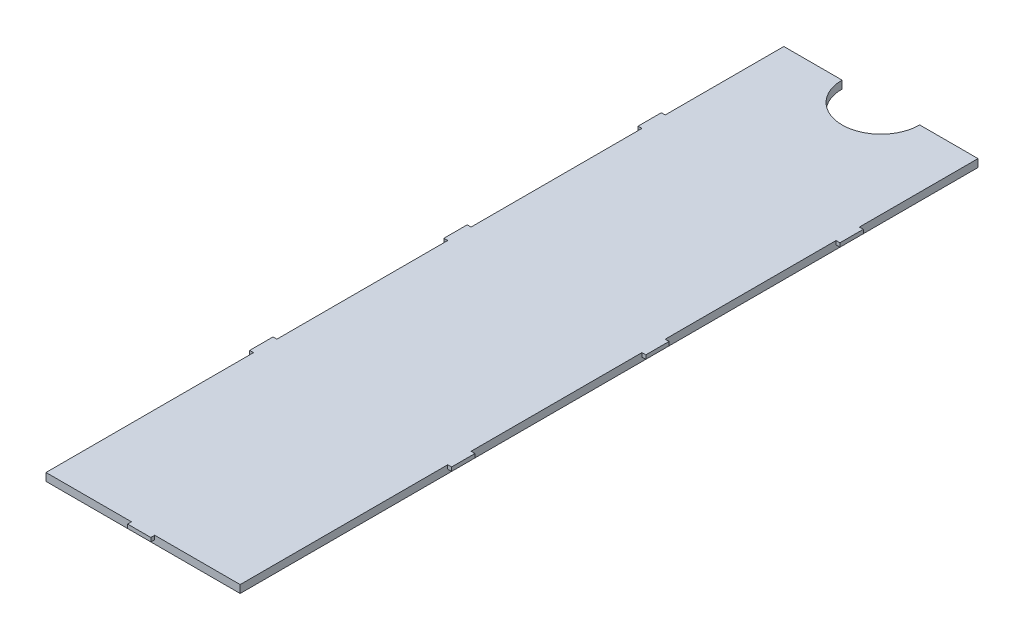
ISO-10303-21;
HEADER;
FILE_DESCRIPTION(('STEP AP214'),'2;1');
FILE_NAME('part.step','',(''),(''),'','','');
FILE_SCHEMA(('AUTOMOTIVE_DESIGN { 1 0 10303 214 1 1 1 1 }'));
ENDSEC;
DATA;
#1=APPLICATION_CONTEXT('core data for automotive mechanical design processes');
#2=APPLICATION_PROTOCOL_DEFINITION('international standard','automotive_design',2000,#1);
#3=PRODUCT_CONTEXT('',#1,'mechanical');
#4=PRODUCT('Part','Part','',(#3));
#5=PRODUCT_RELATED_PRODUCT_CATEGORY('part','',(#4));
#6=PRODUCT_DEFINITION_FORMATION('','',#4);
#7=PRODUCT_DEFINITION_CONTEXT('part definition',#1,'design');
#8=PRODUCT_DEFINITION('design','',#6,#7);
#9=PRODUCT_DEFINITION_SHAPE('','',#8);
#10=(LENGTH_UNIT() NAMED_UNIT(*) SI_UNIT(.MILLI.,.METRE.));
#11=(NAMED_UNIT(*) PLANE_ANGLE_UNIT() SI_UNIT($,.RADIAN.));
#12=(NAMED_UNIT(*) SI_UNIT($,.STERADIAN.) SOLID_ANGLE_UNIT());
#13=UNCERTAINTY_MEASURE_WITH_UNIT(LENGTH_MEASURE(1.E-05),#10,'distance_accuracy_value','');
#14=(GEOMETRIC_REPRESENTATION_CONTEXT(3) GLOBAL_UNCERTAINTY_ASSIGNED_CONTEXT((#13)) GLOBAL_UNIT_ASSIGNED_CONTEXT((#10,
#11,#12)) REPRESENTATION_CONTEXT('',''));
#15=CARTESIAN_POINT('',(0.,0.,0.));
#16=DIRECTION('',(0.,0.,1.));
#17=DIRECTION('',(1.,0.,0.));
#18=AXIS2_PLACEMENT_3D('',#15,#16,#17);
#19=CARTESIAN_POINT('',(0.,35.274050100301,1.80750317688863));
#20=DIRECTION('',(0.,0.,1.));
#21=DIRECTION('',(1.,0.,0.));
#22=AXIS2_PLACEMENT_3D('',#19,#20,#21);
#23=PLANE('',#22);
#24=DIRECTION('',(-1.,0.,0.));
#25=VECTOR('',#24,1.);
#26=CARTESIAN_POINT('',(0.,35.274050100301,1.80750317688863));
#27=LINE('',#26,#25);
#28=CARTESIAN_POINT('',(-86.6012572167533,35.274050100301,1.80750317688863));
#29=VERTEX_POINT('',#28);
#30=CARTESIAN_POINT('',(-94.1012572167536,35.274050100301,1.80750317688863));
#31=VERTEX_POINT('',#30);
#32=EDGE_CURVE('E280',#29,#31,#27,.T.);
#33=ORIENTED_EDGE('',*,*,#32,.F.);
#34=DIRECTION('',(0.,-1.,0.));
#35=VECTOR('',#34,1.);
#36=CARTESIAN_POINT('',(-86.6012572167533,35.274050100301,1.80750317688863));
#37=LINE('',#36,#35);
#38=CARTESIAN_POINT('',(-86.6012572167533,34.274050100301,1.80750317688863));
#39=VERTEX_POINT('',#38);
#40=EDGE_CURVE('E261',#29,#39,#37,.T.);
#41=ORIENTED_EDGE('',*,*,#40,.T.);
#42=DIRECTION('',(-1.,0.,0.));
#43=VECTOR('',#42,1.);
#44=CARTESIAN_POINT('',(0.,34.274050100301,1.80750317688863));
#45=LINE('',#44,#43);
#46=CARTESIAN_POINT('',(-94.1012572167536,34.274050100301,1.80750317688863));
#47=VERTEX_POINT('',#46);
#48=EDGE_CURVE('E296',#39,#47,#45,.T.);
#49=ORIENTED_EDGE('',*,*,#48,.T.);
#50=DIRECTION('',(0.,-1.,0.));
#51=VECTOR('',#50,1.);
#52=CARTESIAN_POINT('',(-94.1012572167536,35.274050100301,1.80750317688863));
#53=LINE('',#52,#51);
#54=EDGE_CURVE('E292',#31,#47,#53,.T.);
#55=ORIENTED_EDGE('',*,*,#54,.F.);
#56=EDGE_LOOP('',(#33,#41,#49,#55));
#57=FACE_BOUND('',#56,.T.);
#58=ADVANCED_FACE('F41',(#57),#23,.F.);
#59=CARTESIAN_POINT('',(-94.1012572167536,35.274050100301,0.));
#60=DIRECTION('',(1.,0.,0.));
#61=DIRECTION('',(0.,0.,-1.));
#62=AXIS2_PLACEMENT_3D('',#59,#60,#61);
#63=PLANE('',#62);
#64=DIRECTION('',(0.,0.,-1.));
#65=VECTOR('',#64,1.);
#66=CARTESIAN_POINT('',(-94.1012572167536,34.774050100301,0.));
#67=LINE('',#66,#65);
#68=CARTESIAN_POINT('',(-94.1012572167536,34.774050100301,20.0802620856482));
#69=VERTEX_POINT('',#68);
#70=CARTESIAN_POINT('',(-94.1012572167536,34.774050100301,17.0802620856482));
#71=VERTEX_POINT('',#70);
#72=EDGE_CURVE('E326',#69,#71,#67,.T.);
#73=ORIENTED_EDGE('',*,*,#72,.T.);
#74=DIRECTION('',(0.,1.,0.));
#75=VECTOR('',#74,1.);
#76=CARTESIAN_POINT('',(-94.1012572167536,35.274050100301,17.0802620856482));
#77=LINE('',#76,#75);
#78=CARTESIAN_POINT('',(-94.1012572167536,35.274050100301,17.0802620856482));
#79=VERTEX_POINT('',#78);
#80=EDGE_CURVE('E388',#71,#79,#77,.T.);
#81=ORIENTED_EDGE('',*,*,#80,.T.);
#82=DIRECTION('',(0.,0.,1.));
#83=VECTOR('',#82,1.);
#84=CARTESIAN_POINT('',(-94.1012572167536,35.274050100301,0.));
#85=LINE('',#84,#83);
#86=EDGE_CURVE('E284',#31,#79,#85,.T.);
#87=ORIENTED_EDGE('',*,*,#86,.F.);
#88=ORIENTED_EDGE('',*,*,#54,.T.);
#89=DIRECTION('',(0.,0.,1.));
#90=VECTOR('',#89,1.);
#91=CARTESIAN_POINT('',(-94.1012572167536,34.274050100301,0.));
#92=LINE('',#91,#90);
#93=CARTESIAN_POINT('',(-94.1012572167536,34.274050100301,96.8075031768886));
#94=VERTEX_POINT('',#93);
#95=EDGE_CURVE('E293',#47,#94,#92,.T.);
#96=ORIENTED_EDGE('',*,*,#95,.T.);
#97=DIRECTION('',(0.,-1.,0.));
#98=VECTOR('',#97,1.);
#99=CARTESIAN_POINT('',(-94.1012572167536,35.274050100301,96.8075031768886));
#100=LINE('',#99,#98);
#101=CARTESIAN_POINT('',(-94.1012572167536,35.274050100301,96.8075031768886));
#102=VERTEX_POINT('',#101);
#103=EDGE_CURVE('E306',#102,#94,#100,.T.);
#104=ORIENTED_EDGE('',*,*,#103,.F.);
#105=CARTESIAN_POINT('',(-94.1012572167536,35.274050100301,70.0802620856482));
#106=VERTEX_POINT('',#105);
#107=EDGE_CURVE('E305',#106,#102,#85,.T.);
#108=ORIENTED_EDGE('',*,*,#107,.F.);
#109=DIRECTION('',(0.,-1.,0.));
#110=VECTOR('',#109,1.);
#111=CARTESIAN_POINT('',(-94.1012572167536,35.274050100301,70.0802620856482));
#112=LINE('',#111,#110);
#113=CARTESIAN_POINT('',(-94.1012572167536,34.774050100301,70.0802620856482));
#114=VERTEX_POINT('',#113);
#115=EDGE_CURVE('E431',#106,#114,#112,.T.);
#116=ORIENTED_EDGE('',*,*,#115,.T.);
#117=DIRECTION('',(0.,0.,-1.));
#118=VECTOR('',#117,1.);
#119=CARTESIAN_POINT('',(-94.1012572167536,34.774050100301,0.));
#120=LINE('',#119,#118);
#121=CARTESIAN_POINT('',(-94.1012572167536,34.774050100301,67.0802620856482));
#122=VERTEX_POINT('',#121);
#123=EDGE_CURVE('E320',#114,#122,#120,.T.);
#124=ORIENTED_EDGE('',*,*,#123,.T.);
#125=DIRECTION('',(0.,1.,0.));
#126=VECTOR('',#125,1.);
#127=CARTESIAN_POINT('',(-94.1012572167536,35.274050100301,67.0802620856482));
#128=LINE('',#127,#126);
#129=CARTESIAN_POINT('',(-94.1012572167536,35.274050100301,67.0802620856482));
#130=VERTEX_POINT('',#129);
#131=EDGE_CURVE('E440',#122,#130,#128,.T.);
#132=ORIENTED_EDGE('',*,*,#131,.T.);
#133=CARTESIAN_POINT('',(-94.1012572167536,35.274050100301,45.0802620856482));
#134=VERTEX_POINT('',#133);
#135=EDGE_CURVE('E915',#134,#130,#85,.T.);
#136=ORIENTED_EDGE('',*,*,#135,.F.);
#137=DIRECTION('',(0.,-1.,0.));
#138=VECTOR('',#137,1.);
#139=CARTESIAN_POINT('',(-94.1012572167536,35.274050100301,45.0802620856482));
#140=LINE('',#139,#138);
#141=CARTESIAN_POINT('',(-94.1012572167536,34.774050100301,45.0802620856482));
#142=VERTEX_POINT('',#141);
#143=EDGE_CURVE('E405',#134,#142,#140,.T.);
#144=ORIENTED_EDGE('',*,*,#143,.T.);
#145=DIRECTION('',(0.,0.,-1.));
#146=VECTOR('',#145,1.);
#147=CARTESIAN_POINT('',(-94.1012572167536,34.774050100301,0.));
#148=LINE('',#147,#146);
#149=CARTESIAN_POINT('',(-94.1012572167536,34.774050100301,42.0802620856482));
#150=VERTEX_POINT('',#149);
#151=EDGE_CURVE('E323',#142,#150,#148,.T.);
#152=ORIENTED_EDGE('',*,*,#151,.T.);
#153=DIRECTION('',(0.,1.,0.));
#154=VECTOR('',#153,1.);
#155=CARTESIAN_POINT('',(-94.1012572167536,35.274050100301,42.0802620856482));
#156=LINE('',#155,#154);
#157=CARTESIAN_POINT('',(-94.1012572167536,35.274050100301,42.0802620856482));
#158=VERTEX_POINT('',#157);
#159=EDGE_CURVE('E414',#150,#158,#156,.T.);
#160=ORIENTED_EDGE('',*,*,#159,.T.);
#161=CARTESIAN_POINT('',(-94.1012572167536,35.274050100301,20.0802620856482));
#162=VERTEX_POINT('',#161);
#163=EDGE_CURVE('E914',#162,#158,#85,.T.);
#164=ORIENTED_EDGE('',*,*,#163,.F.);
#165=DIRECTION('',(0.,-1.,0.));
#166=VECTOR('',#165,1.);
#167=CARTESIAN_POINT('',(-94.1012572167536,35.274050100301,20.0802620856482));
#168=LINE('',#167,#166);
#169=EDGE_CURVE('E380',#162,#69,#168,.T.);
#170=ORIENTED_EDGE('',*,*,#169,.T.);
#171=EDGE_LOOP('',(#73,#81,#87,#88,#96,#104,#108,#116,#124,#132,#136,#144,#152,#160,#164,#170));
#172=FACE_BOUND('',#171,.T.);
#173=ADVANCED_FACE('F43',(#172),#63,.F.);
#174=CARTESIAN_POINT('',(0.,35.274050100301,96.8075031768886));
#175=DIRECTION('',(0.,0.,1.));
#176=DIRECTION('',(1.,0.,0.));
#177=AXIS2_PLACEMENT_3D('',#174,#175,#176);
#178=PLANE('',#177);
#179=DIRECTION('',(0.,1.,0.));
#180=VECTOR('',#179,1.);
#181=CARTESIAN_POINT('',(-80.1012572167533,35.274050100301,96.8075031768886));
#182=LINE('',#181,#180);
#183=CARTESIAN_POINT('',(-80.1012572167533,34.774050100301,96.8075031768886));
#184=VERTEX_POINT('',#183);
#185=CARTESIAN_POINT('',(-80.1012572167533,35.274050100301,96.8075031768886));
#186=VERTEX_POINT('',#185);
#187=EDGE_CURVE('E467',#184,#186,#182,.T.);
#188=ORIENTED_EDGE('',*,*,#187,.F.);
#189=DIRECTION('',(1.,0.,0.));
#190=VECTOR('',#189,1.);
#191=CARTESIAN_POINT('',(0.,34.774050100301,96.8075031768886));
#192=LINE('',#191,#190);
#193=CARTESIAN_POINT('',(-83.1012572167533,34.774050100301,96.8075031768886));
#194=VERTEX_POINT('',#193);
#195=EDGE_CURVE('E317',#194,#184,#192,.T.);
#196=ORIENTED_EDGE('',*,*,#195,.F.);
#197=DIRECTION('',(0.,-1.,0.));
#198=VECTOR('',#197,1.);
#199=CARTESIAN_POINT('',(-83.1012572167533,35.274050100301,96.8075031768886));
#200=LINE('',#199,#198);
#201=CARTESIAN_POINT('',(-83.1012572167533,35.274050100301,96.8075031768886));
#202=VERTEX_POINT('',#201);
#203=EDGE_CURVE('E458',#202,#194,#200,.T.);
#204=ORIENTED_EDGE('',*,*,#203,.F.);
#205=DIRECTION('',(-1.,0.,0.));
#206=VECTOR('',#205,1.);
#207=CARTESIAN_POINT('',(0.,35.274050100301,96.8075031768886));
#208=LINE('',#207,#206);
#209=EDGE_CURVE('E288',#202,#102,#208,.T.);
#210=ORIENTED_EDGE('',*,*,#209,.T.);
#211=ORIENTED_EDGE('',*,*,#103,.T.);
#212=DIRECTION('',(-1.,0.,0.));
#213=VECTOR('',#212,1.);
#214=CARTESIAN_POINT('',(0.,34.274050100301,96.8075031768886));
#215=LINE('',#214,#213);
#216=CARTESIAN_POINT('',(-69.1012572167529,34.274050100301,96.8075031768886));
#217=VERTEX_POINT('',#216);
#218=EDGE_CURVE('E302',#217,#94,#215,.T.);
#219=ORIENTED_EDGE('',*,*,#218,.F.);
#220=DIRECTION('',(0.,-1.,0.));
#221=VECTOR('',#220,1.);
#222=CARTESIAN_POINT('',(-69.1012572167529,35.274050100301,96.8075031768886));
#223=LINE('',#222,#221);
#224=CARTESIAN_POINT('',(-69.1012572167529,35.274050100301,96.8075031768886));
#225=VERTEX_POINT('',#224);
#226=EDGE_CURVE('E309',#225,#217,#223,.T.);
#227=ORIENTED_EDGE('',*,*,#226,.F.);
#228=EDGE_CURVE('E290',#225,#186,#208,.T.);
#229=ORIENTED_EDGE('',*,*,#228,.T.);
#230=EDGE_LOOP('',(#188,#196,#204,#210,#211,#219,#227,#229));
#231=FACE_BOUND('',#230,.T.);
#232=ADVANCED_FACE('F527',(#231),#178,.T.);
#233=CARTESIAN_POINT('',(-69.1012572167529,35.274050100301,0.));
#234=DIRECTION('',(1.,0.,0.));
#235=DIRECTION('',(0.,0.,-1.));
#236=AXIS2_PLACEMENT_3D('',#233,#234,#235);
#237=PLANE('',#236);
#238=DIRECTION('',(0.,1.,0.));
#239=VECTOR('',#238,1.);
#240=CARTESIAN_POINT('',(-69.1012572167529,35.274050100301,67.0802620856482));
#241=LINE('',#240,#239);
#242=CARTESIAN_POINT('',(-69.1012572167529,34.774050100301,67.0802620856482));
#243=VERTEX_POINT('',#242);
#244=CARTESIAN_POINT('',(-69.1012572167529,35.274050100301,67.0802620856482));
#245=VERTEX_POINT('',#244);
#246=EDGE_CURVE('E890',#243,#245,#241,.T.);
#247=ORIENTED_EDGE('',*,*,#246,.F.);
#248=DIRECTION('',(0.,0.,-1.));
#249=VECTOR('',#248,1.);
#250=CARTESIAN_POINT('',(-69.1012572167529,34.774050100301,0.));
#251=LINE('',#250,#249);
#252=CARTESIAN_POINT('',(-69.1012572167529,34.774050100301,70.0802620856482));
#253=VERTEX_POINT('',#252);
#254=EDGE_CURVE('E11',#253,#243,#251,.T.);
#255=ORIENTED_EDGE('',*,*,#254,.F.);
#256=DIRECTION('',(0.,-1.,0.));
#257=VECTOR('',#256,1.);
#258=CARTESIAN_POINT('',(-69.1012572167529,35.274050100301,70.0802620856482));
#259=LINE('',#258,#257);
#260=CARTESIAN_POINT('',(-69.1012572167529,35.274050100301,70.0802620856482));
#261=VERTEX_POINT('',#260);
#262=EDGE_CURVE('E875',#261,#253,#259,.T.);
#263=ORIENTED_EDGE('',*,*,#262,.F.);
#264=DIRECTION('',(0.,0.,1.));
#265=VECTOR('',#264,1.);
#266=CARTESIAN_POINT('',(-69.1012572167529,35.274050100301,0.));
#267=LINE('',#266,#265);
#268=EDGE_CURVE('E279',#261,#225,#267,.T.);
#269=ORIENTED_EDGE('',*,*,#268,.T.);
#270=ORIENTED_EDGE('',*,*,#226,.T.);
#271=DIRECTION('',(0.,0.,1.));
#272=VECTOR('',#271,1.);
#273=CARTESIAN_POINT('',(-69.1012572167529,34.274050100301,0.));
#274=LINE('',#273,#272);
#275=CARTESIAN_POINT('',(-69.1012572167529,34.274050100301,1.80750317688863));
#276=VERTEX_POINT('',#275);
#277=EDGE_CURVE('E299',#276,#217,#274,.T.);
#278=ORIENTED_EDGE('',*,*,#277,.F.);
#279=DIRECTION('',(0.,-1.,0.));
#280=VECTOR('',#279,1.);
#281=CARTESIAN_POINT('',(-69.1012572167529,35.274050100301,1.80750317688863));
#282=LINE('',#281,#280);
#283=CARTESIAN_POINT('',(-69.1012572167529,35.274050100301,1.80750317688863));
#284=VERTEX_POINT('',#283);
#285=EDGE_CURVE('E311',#284,#276,#282,.T.);
#286=ORIENTED_EDGE('',*,*,#285,.F.);
#287=CARTESIAN_POINT('',(-69.1012572167529,35.274050100301,17.0802620856482));
#288=VERTEX_POINT('',#287);
#289=EDGE_CURVE('E278',#284,#288,#267,.T.);
#290=ORIENTED_EDGE('',*,*,#289,.T.);
#291=DIRECTION('',(0.,1.,0.));
#292=VECTOR('',#291,1.);
#293=CARTESIAN_POINT('',(-69.1012572167529,35.274050100301,17.0802620856482));
#294=LINE('',#293,#292);
#295=CARTESIAN_POINT('',(-69.1012572167529,34.774050100301,17.0802620856482));
#296=VERTEX_POINT('',#295);
#297=EDGE_CURVE('E297',#296,#288,#294,.T.);
#298=ORIENTED_EDGE('',*,*,#297,.F.);
#299=DIRECTION('',(0.,0.,-1.));
#300=VECTOR('',#299,1.);
#301=CARTESIAN_POINT('',(-69.1012572167529,34.774050100301,0.));
#302=LINE('',#301,#300);
#303=CARTESIAN_POINT('',(-69.1012572167529,34.774050100301,20.0802620856482));
#304=VERTEX_POINT('',#303);
#305=EDGE_CURVE('E308',#304,#296,#302,.T.);
#306=ORIENTED_EDGE('',*,*,#305,.F.);
#307=DIRECTION('',(0.,-1.,0.));
#308=VECTOR('',#307,1.);
#309=CARTESIAN_POINT('',(-69.1012572167529,35.274050100301,20.0802620856482));
#310=LINE('',#309,#308);
#311=CARTESIAN_POINT('',(-69.1012572167529,35.274050100301,20.0802620856482));
#312=VERTEX_POINT('',#311);
#313=EDGE_CURVE('E490',#312,#304,#310,.T.);
#314=ORIENTED_EDGE('',*,*,#313,.F.);
#315=CARTESIAN_POINT('',(-69.1012572167529,35.274050100301,42.0802620856482));
#316=VERTEX_POINT('',#315);
#317=EDGE_CURVE('E289',#312,#316,#267,.T.);
#318=ORIENTED_EDGE('',*,*,#317,.T.);
#319=DIRECTION('',(0.,1.,0.));
#320=VECTOR('',#319,1.);
#321=CARTESIAN_POINT('',(-69.1012572167529,35.274050100301,42.0802620856482));
#322=LINE('',#321,#320);
#323=CARTESIAN_POINT('',(-69.1012572167529,34.774050100301,42.0802620856482));
#324=VERTEX_POINT('',#323);
#325=EDGE_CURVE('E342',#324,#316,#322,.T.);
#326=ORIENTED_EDGE('',*,*,#325,.F.);
#327=DIRECTION('',(0.,0.,-1.));
#328=VECTOR('',#327,1.);
#329=CARTESIAN_POINT('',(-69.1012572167529,34.774050100301,0.));
#330=LINE('',#329,#328);
#331=CARTESIAN_POINT('',(-69.1012572167529,34.774050100301,45.0802620856482));
#332=VERTEX_POINT('',#331);
#333=EDGE_CURVE('E49',#332,#324,#330,.T.);
#334=ORIENTED_EDGE('',*,*,#333,.F.);
#335=DIRECTION('',(0.,-1.,0.));
#336=VECTOR('',#335,1.);
#337=CARTESIAN_POINT('',(-69.1012572167529,35.274050100301,45.0802620856482));
#338=LINE('',#337,#336);
#339=CARTESIAN_POINT('',(-69.1012572167529,35.274050100301,45.0802620856482));
#340=VERTEX_POINT('',#339);
#341=EDGE_CURVE('E358',#340,#332,#338,.T.);
#342=ORIENTED_EDGE('',*,*,#341,.F.);
#343=EDGE_CURVE('E282',#340,#245,#267,.T.);
#344=ORIENTED_EDGE('',*,*,#343,.T.);
#345=EDGE_LOOP('',(#247,#255,#263,#269,#270,#278,#286,#290,#298,#306,#314,#318,#326,#334,#342,#344));
#346=FACE_BOUND('',#345,.T.);
#347=ADVANCED_FACE('F507',(#346),#237,.T.);
#348=CARTESIAN_POINT('',(-76.6012572167533,34.274050100301,1.80750317688863));
#349=VERTEX_POINT('',#348);
#350=EDGE_CURVE('E274',#276,#349,#45,.T.);
#351=ORIENTED_EDGE('',*,*,#350,.T.);
#352=DIRECTION('',(0.,-1.,0.));
#353=VECTOR('',#352,1.);
#354=CARTESIAN_POINT('',(-76.6012572167533,35.274050100301,1.80750317688863));
#355=LINE('',#354,#353);
#356=CARTESIAN_POINT('',(-76.6012572167533,35.274050100301,1.80750317688863));
#357=VERTEX_POINT('',#356);
#358=EDGE_CURVE('E56',#349,#357,#355,.F.);
#359=ORIENTED_EDGE('',*,*,#358,.T.);
#360=EDGE_CURVE('E271',#284,#357,#27,.T.);
#361=ORIENTED_EDGE('',*,*,#360,.F.);
#362=ORIENTED_EDGE('',*,*,#285,.T.);
#363=EDGE_LOOP('',(#351,#359,#361,#362));
#364=FACE_BOUND('',#363,.T.);
#365=ADVANCED_FACE('F270',(#364),#23,.F.);
#366=CARTESIAN_POINT('',(0.,35.274050100301,0.));
#367=DIRECTION('',(0.,-1.,0.));
#368=DIRECTION('',(0.,0.,-1.));
#369=AXIS2_PLACEMENT_3D('',#366,#367,#368);
#370=PLANE('',#369);
#371=ORIENTED_EDGE('',*,*,#360,.T.);
#372=CARTESIAN_POINT('',(-81.6012572167533,35.274050100301,1.80750317688863));
#373=DIRECTION('',(0.,-1.,0.));
#374=DIRECTION('',(0.,0.,-1.));
#375=AXIS2_PLACEMENT_3D('',#372,#373,#374);
#376=CIRCLE('',#375,5.);
#377=EDGE_CURVE('E258',#357,#29,#376,.T.);
#378=ORIENTED_EDGE('',*,*,#377,.T.);
#379=ORIENTED_EDGE('',*,*,#32,.T.);
#380=ORIENTED_EDGE('',*,*,#86,.T.);
#381=DIRECTION('',(1.,0.,0.));
#382=VECTOR('',#381,1.);
#383=CARTESIAN_POINT('',(-94.6012572167536,35.274050100301,17.0802620856482));
#384=LINE('',#383,#382);
#385=CARTESIAN_POINT('',(-94.6012572167536,35.274050100301,17.0802620856482));
#386=VERTEX_POINT('',#385);
#387=EDGE_CURVE('E376',#386,#79,#384,.T.);
#388=ORIENTED_EDGE('',*,*,#387,.F.);
#389=DIRECTION('',(0.,0.,-1.));
#390=VECTOR('',#389,1.);
#391=CARTESIAN_POINT('',(-94.6012572167536,35.274050100301,17.0802620856482));
#392=LINE('',#391,#390);
#393=CARTESIAN_POINT('',(-94.6012572167536,35.274050100301,20.0802620856482));
#394=VERTEX_POINT('',#393);
#395=EDGE_CURVE('E370',#394,#386,#392,.T.);
#396=ORIENTED_EDGE('',*,*,#395,.F.);
#397=DIRECTION('',(-1.,0.,0.));
#398=VECTOR('',#397,1.);
#399=CARTESIAN_POINT('',(-94.6012572167536,35.274050100301,20.0802620856482));
#400=LINE('',#399,#398);
#401=EDGE_CURVE('E383',#162,#394,#400,.T.);
#402=ORIENTED_EDGE('',*,*,#401,.F.);
#403=ORIENTED_EDGE('',*,*,#163,.T.);
#404=DIRECTION('',(1.,0.,0.));
#405=VECTOR('',#404,1.);
#406=CARTESIAN_POINT('',(-94.6012572167536,35.274050100301,42.0802620856482));
#407=LINE('',#406,#405);
#408=CARTESIAN_POINT('',(-94.6012572167536,35.274050100301,42.0802620856482));
#409=VERTEX_POINT('',#408);
#410=EDGE_CURVE('E401',#409,#158,#407,.T.);
#411=ORIENTED_EDGE('',*,*,#410,.F.);
#412=DIRECTION('',(0.,0.,-1.));
#413=VECTOR('',#412,1.);
#414=CARTESIAN_POINT('',(-94.6012572167536,35.274050100301,42.0802620856482));
#415=LINE('',#414,#413);
#416=CARTESIAN_POINT('',(-94.6012572167536,35.274050100301,45.0802620856482));
#417=VERTEX_POINT('',#416);
#418=EDGE_CURVE('E395',#417,#409,#415,.T.);
#419=ORIENTED_EDGE('',*,*,#418,.F.);
#420=DIRECTION('',(-1.,0.,0.));
#421=VECTOR('',#420,1.);
#422=CARTESIAN_POINT('',(-94.6012572167536,35.274050100301,45.0802620856482));
#423=LINE('',#422,#421);
#424=EDGE_CURVE('E408',#134,#417,#423,.T.);
#425=ORIENTED_EDGE('',*,*,#424,.F.);
#426=ORIENTED_EDGE('',*,*,#135,.T.);
#427=DIRECTION('',(1.,0.,0.));
#428=VECTOR('',#427,1.);
#429=CARTESIAN_POINT('',(-94.6012572167536,35.274050100301,67.0802620856482));
#430=LINE('',#429,#428);
#431=CARTESIAN_POINT('',(-94.6012572167536,35.274050100301,67.0802620856482));
#432=VERTEX_POINT('',#431);
#433=EDGE_CURVE('E427',#432,#130,#430,.T.);
#434=ORIENTED_EDGE('',*,*,#433,.F.);
#435=DIRECTION('',(0.,0.,-1.));
#436=VECTOR('',#435,1.);
#437=CARTESIAN_POINT('',(-94.6012572167536,35.274050100301,67.0802620856482));
#438=LINE('',#437,#436);
#439=CARTESIAN_POINT('',(-94.6012572167536,35.274050100301,70.0802620856482));
#440=VERTEX_POINT('',#439);
#441=EDGE_CURVE('E421',#440,#432,#438,.T.);
#442=ORIENTED_EDGE('',*,*,#441,.F.);
#443=DIRECTION('',(-1.,0.,0.));
#444=VECTOR('',#443,1.);
#445=CARTESIAN_POINT('',(-94.6012572167536,35.274050100301,70.0802620856482));
#446=LINE('',#445,#444);
#447=EDGE_CURVE('E434',#106,#440,#446,.T.);
#448=ORIENTED_EDGE('',*,*,#447,.F.);
#449=ORIENTED_EDGE('',*,*,#107,.T.);
#450=ORIENTED_EDGE('',*,*,#209,.F.);
#451=DIRECTION('',(0.,0.,-1.));
#452=VECTOR('',#451,1.);
#453=CARTESIAN_POINT('',(-83.1012572167533,35.274050100301,96.3075031768883));
#454=LINE('',#453,#452);
#455=CARTESIAN_POINT('',(-83.1012572167533,35.274050100301,97.3075031768886));
#456=VERTEX_POINT('',#455);
#457=EDGE_CURVE('E447',#456,#202,#454,.T.);
#458=ORIENTED_EDGE('',*,*,#457,.F.);
#459=DIRECTION('',(-1.,0.,0.));
#460=VECTOR('',#459,1.);
#461=CARTESIAN_POINT('',(-80.1012572167533,35.274050100301,97.3075031768886));
#462=LINE('',#461,#460);
#463=CARTESIAN_POINT('',(-80.1012572167533,35.274050100301,97.3075031768886));
#464=VERTEX_POINT('',#463);
#465=EDGE_CURVE('E461',#464,#456,#462,.T.);
#466=ORIENTED_EDGE('',*,*,#465,.F.);
#467=DIRECTION('',(0.,0.,1.));
#468=VECTOR('',#467,1.);
#469=CARTESIAN_POINT('',(-80.1012572167533,35.274050100301,96.3075031768883));
#470=LINE('',#469,#468);
#471=EDGE_CURVE('E453',#186,#464,#470,.T.);
#472=ORIENTED_EDGE('',*,*,#471,.F.);
#473=ORIENTED_EDGE('',*,*,#228,.F.);
#474=ORIENTED_EDGE('',*,*,#268,.F.);
#475=DIRECTION('',(-1.,0.,0.));
#476=VECTOR('',#475,1.);
#477=CARTESIAN_POINT('',(-68.6012572167529,35.274050100301,70.0802620856482));
#478=LINE('',#477,#476);
#479=CARTESIAN_POINT('',(-68.6012572167529,35.274050100301,70.0802620856482));
#480=VERTEX_POINT('',#479);
#481=EDGE_CURVE('E883',#480,#261,#478,.T.);
#482=ORIENTED_EDGE('',*,*,#481,.F.);
#483=DIRECTION('',(0.,0.,1.));
#484=VECTOR('',#483,1.);
#485=CARTESIAN_POINT('',(-68.6012572167529,35.274050100301,67.0802620856482));
#486=LINE('',#485,#484);
#487=CARTESIAN_POINT('',(-68.6012572167529,35.274050100301,67.0802620856482));
#488=VERTEX_POINT('',#487);
#489=EDGE_CURVE('E877',#488,#480,#486,.T.);
#490=ORIENTED_EDGE('',*,*,#489,.F.);
#491=DIRECTION('',(1.,0.,0.));
#492=VECTOR('',#491,1.);
#493=CARTESIAN_POINT('',(-68.6012572167529,35.274050100301,67.0802620856482));
#494=LINE('',#493,#492);
#495=EDGE_CURVE('E881',#245,#488,#494,.T.);
#496=ORIENTED_EDGE('',*,*,#495,.F.);
#497=ORIENTED_EDGE('',*,*,#343,.F.);
#498=DIRECTION('',(-1.,0.,0.));
#499=VECTOR('',#498,1.);
#500=CARTESIAN_POINT('',(-68.6012572167529,35.274050100301,45.0802620856482));
#501=LINE('',#500,#499);
#502=CARTESIAN_POINT('',(-68.6012572167529,35.274050100301,45.0802620856482));
#503=VERTEX_POINT('',#502);
#504=EDGE_CURVE('E352',#503,#340,#501,.T.);
#505=ORIENTED_EDGE('',*,*,#504,.F.);
#506=DIRECTION('',(0.,0.,1.));
#507=VECTOR('',#506,1.);
#508=CARTESIAN_POINT('',(-68.6012572167529,35.274050100301,42.0802620856482));
#509=LINE('',#508,#507);
#510=CARTESIAN_POINT('',(-68.6012572167529,35.274050100301,42.0802620856482));
#511=VERTEX_POINT('',#510);
#512=EDGE_CURVE('E347',#511,#503,#509,.T.);
#513=ORIENTED_EDGE('',*,*,#512,.F.);
#514=DIRECTION('',(1.,0.,0.));
#515=VECTOR('',#514,1.);
#516=CARTESIAN_POINT('',(-68.6012572167529,35.274050100301,42.0802620856482));
#517=LINE('',#516,#515);
#518=EDGE_CURVE('E359',#316,#511,#517,.T.);
#519=ORIENTED_EDGE('',*,*,#518,.F.);
#520=ORIENTED_EDGE('',*,*,#317,.F.);
#521=DIRECTION('',(-1.,0.,0.));
#522=VECTOR('',#521,1.);
#523=CARTESIAN_POINT('',(-68.6012572167529,35.274050100301,20.0802620856482));
#524=LINE('',#523,#522);
#525=CARTESIAN_POINT('',(-68.6012572167529,35.274050100301,20.0802620856482));
#526=VERTEX_POINT('',#525);
#527=EDGE_CURVE('E474',#526,#312,#524,.T.);
#528=ORIENTED_EDGE('',*,*,#527,.F.);
#529=DIRECTION('',(0.,0.,1.));
#530=VECTOR('',#529,1.);
#531=CARTESIAN_POINT('',(-68.6012572167529,35.274050100301,17.0802620856482));
#532=LINE('',#531,#530);
#533=CARTESIAN_POINT('',(-68.6012572167529,35.274050100301,17.0802620856482));
#534=VERTEX_POINT('',#533);
#535=EDGE_CURVE('E471',#534,#526,#532,.T.);
#536=ORIENTED_EDGE('',*,*,#535,.F.);
#537=DIRECTION('',(1.,0.,0.));
#538=VECTOR('',#537,1.);
#539=CARTESIAN_POINT('',(-68.6012572167529,35.274050100301,17.0802620856482));
#540=LINE('',#539,#538);
#541=EDGE_CURVE('E478',#288,#534,#540,.T.);
#542=ORIENTED_EDGE('',*,*,#541,.F.);
#543=ORIENTED_EDGE('',*,*,#289,.F.);
#544=EDGE_LOOP('',(#371,#378,#379,#380,#388,#396,#402,#403,#411,#419,#425,#426,#434,#442,#448,
#449,#450,#458,#466,#472,#473,#474,#482,#490,#496,#497,#505,#513,#519,#520,#528,#536,#542,#543));
#545=FACE_BOUND('',#544,.T.);
#546=ADVANCED_FACE('F276',(#545),#370,.F.);
#547=CARTESIAN_POINT('',(0.,34.274050100301,0.));
#548=DIRECTION('',(0.,-1.,0.));
#549=DIRECTION('',(0.,0.,-1.));
#550=AXIS2_PLACEMENT_3D('',#547,#548,#549);
#551=PLANE('',#550);
#552=CARTESIAN_POINT('',(-81.6012572167533,34.274050100301,1.80750317688863));
#553=DIRECTION('',(0.,-1.,0.));
#554=DIRECTION('',(0.,0.,-1.));
#555=AXIS2_PLACEMENT_3D('',#552,#553,#554);
#556=CIRCLE('',#555,5.);
#557=EDGE_CURVE('E265',#349,#39,#556,.T.);
#558=ORIENTED_EDGE('',*,*,#557,.F.);
#559=ORIENTED_EDGE('',*,*,#350,.F.);
#560=ORIENTED_EDGE('',*,*,#277,.T.);
#561=ORIENTED_EDGE('',*,*,#218,.T.);
#562=ORIENTED_EDGE('',*,*,#95,.F.);
#563=ORIENTED_EDGE('',*,*,#48,.F.);
#564=EDGE_LOOP('',(#558,#559,#560,#561,#562,#563));
#565=FACE_BOUND('',#564,.T.);
#566=ADVANCED_FACE('F533',(#565),#551,.T.);
#567=CARTESIAN_POINT('',(-68.6012572167529,35.274050100301,17.0802620856482));
#568=DIRECTION('',(1.,0.,0.));
#569=DIRECTION('',(0.,0.,-1.));
#570=AXIS2_PLACEMENT_3D('',#567,#568,#569);
#571=PLANE('',#570);
#572=DIRECTION('',(0.,0.,1.));
#573=VECTOR('',#572,1.);
#574=CARTESIAN_POINT('',(-68.6012572167529,34.774050100301,17.0802620856482));
#575=LINE('',#574,#573);
#576=CARTESIAN_POINT('',(-68.6012572167529,34.774050100301,17.0802620856482));
#577=VERTEX_POINT('',#576);
#578=CARTESIAN_POINT('',(-68.6012572167529,34.774050100301,20.0802620856482));
#579=VERTEX_POINT('',#578);
#580=EDGE_CURVE('E470',#577,#579,#575,.T.);
#581=ORIENTED_EDGE('',*,*,#580,.F.);
#582=DIRECTION('',(0.,-1.,0.));
#583=VECTOR('',#582,1.);
#584=CARTESIAN_POINT('',(-68.6012572167529,35.274050100301,17.0802620856482));
#585=LINE('',#584,#583);
#586=EDGE_CURVE('E487',#534,#577,#585,.T.);
#587=ORIENTED_EDGE('',*,*,#586,.F.);
#588=ORIENTED_EDGE('',*,*,#535,.T.);
#589=DIRECTION('',(0.,-1.,0.));
#590=VECTOR('',#589,1.);
#591=CARTESIAN_POINT('',(-68.6012572167529,35.274050100301,20.0802620856482));
#592=LINE('',#591,#590);
#593=EDGE_CURVE('E480',#526,#579,#592,.T.);
#594=ORIENTED_EDGE('',*,*,#593,.T.);
#595=EDGE_LOOP('',(#581,#587,#588,#594));
#596=FACE_BOUND('',#595,.T.);
#597=ADVANCED_FACE('F503',(#596),#571,.T.);
#598=CARTESIAN_POINT('',(-68.6012572167529,35.274050100301,17.0802620856482));
#599=DIRECTION('',(0.,0.,-1.));
#600=DIRECTION('',(-1.,0.,0.));
#601=AXIS2_PLACEMENT_3D('',#598,#599,#600);
#602=PLANE('',#601);
#603=DIRECTION('',(1.,0.,0.));
#604=VECTOR('',#603,1.);
#605=CARTESIAN_POINT('',(-68.6012572167529,34.774050100301,17.0802620856482));
#606=LINE('',#605,#604);
#607=EDGE_CURVE('E475',#296,#577,#606,.T.);
#608=ORIENTED_EDGE('',*,*,#607,.F.);
#609=ORIENTED_EDGE('',*,*,#297,.T.);
#610=ORIENTED_EDGE('',*,*,#541,.T.);
#611=ORIENTED_EDGE('',*,*,#586,.T.);
#612=EDGE_LOOP('',(#608,#609,#610,#611));
#613=FACE_BOUND('',#612,.T.);
#614=ADVANCED_FACE('F496',(#613),#602,.T.);
#615=CARTESIAN_POINT('',(-68.6012572167529,35.274050100301,20.0802620856482));
#616=DIRECTION('',(0.,0.,1.));
#617=DIRECTION('',(1.,0.,0.));
#618=AXIS2_PLACEMENT_3D('',#615,#616,#617);
#619=PLANE('',#618);
#620=ORIENTED_EDGE('',*,*,#527,.T.);
#621=ORIENTED_EDGE('',*,*,#313,.T.);
#622=DIRECTION('',(-1.,0.,0.));
#623=VECTOR('',#622,1.);
#624=CARTESIAN_POINT('',(-68.6012572167529,34.774050100301,20.0802620856482));
#625=LINE('',#624,#623);
#626=EDGE_CURVE('E483',#579,#304,#625,.T.);
#627=ORIENTED_EDGE('',*,*,#626,.F.);
#628=ORIENTED_EDGE('',*,*,#593,.F.);
#629=EDGE_LOOP('',(#620,#621,#627,#628));
#630=FACE_BOUND('',#629,.T.);
#631=ADVANCED_FACE('F509',(#630),#619,.T.);
#632=CARTESIAN_POINT('',(0.,34.774050100301,0.));
#633=DIRECTION('',(0.,-1.,0.));
#634=DIRECTION('',(0.,0.,-1.));
#635=AXIS2_PLACEMENT_3D('',#632,#633,#634);
#636=PLANE('',#635);
#637=ORIENTED_EDGE('',*,*,#626,.T.);
#638=ORIENTED_EDGE('',*,*,#305,.T.);
#639=ORIENTED_EDGE('',*,*,#607,.T.);
#640=ORIENTED_EDGE('',*,*,#580,.T.);
#641=EDGE_LOOP('',(#637,#638,#639,#640));
#642=FACE_BOUND('',#641,.T.);
#643=ADVANCED_FACE('F506',(#642),#636,.T.);
#644=CARTESIAN_POINT('',(-80.1012572167533,35.274050100301,96.3075031768883));
#645=DIRECTION('',(1.,0.,0.));
#646=DIRECTION('',(0.,0.,-1.));
#647=AXIS2_PLACEMENT_3D('',#644,#645,#646);
#648=PLANE('',#647);
#649=DIRECTION('',(0.,0.,1.));
#650=VECTOR('',#649,1.);
#651=CARTESIAN_POINT('',(-80.1012572167533,34.774050100301,96.3075031768883));
#652=LINE('',#651,#650);
#653=CARTESIAN_POINT('',(-80.1012572167533,34.774050100301,97.3075031768886));
#654=VERTEX_POINT('',#653);
#655=EDGE_CURVE('E456',#184,#654,#652,.T.);
#656=ORIENTED_EDGE('',*,*,#655,.F.);
#657=ORIENTED_EDGE('',*,*,#187,.T.);
#658=ORIENTED_EDGE('',*,*,#471,.T.);
#659=DIRECTION('',(0.,-1.,0.));
#660=VECTOR('',#659,1.);
#661=CARTESIAN_POINT('',(-80.1012572167533,35.274050100301,97.3075031768886));
#662=LINE('',#661,#660);
#663=EDGE_CURVE('E444',#464,#654,#662,.T.);
#664=ORIENTED_EDGE('',*,*,#663,.T.);
#665=EDGE_LOOP('',(#656,#657,#658,#664));
#666=FACE_BOUND('',#665,.T.);
#667=ADVANCED_FACE('F516',(#666),#648,.T.);
#668=CARTESIAN_POINT('',(-83.1012572167533,35.274050100301,96.3075031768883));
#669=DIRECTION('',(-1.,0.,0.));
#670=DIRECTION('',(0.,0.,1.));
#671=AXIS2_PLACEMENT_3D('',#668,#669,#670);
#672=PLANE('',#671);
#673=ORIENTED_EDGE('',*,*,#457,.T.);
#674=ORIENTED_EDGE('',*,*,#203,.T.);
#675=DIRECTION('',(0.,0.,-1.));
#676=VECTOR('',#675,1.);
#677=CARTESIAN_POINT('',(-83.1012572167533,34.774050100301,96.3075031768883));
#678=LINE('',#677,#676);
#679=CARTESIAN_POINT('',(-83.1012572167533,34.774050100301,97.3075031768886));
#680=VERTEX_POINT('',#679);
#681=EDGE_CURVE('E449',#680,#194,#678,.T.);
#682=ORIENTED_EDGE('',*,*,#681,.F.);
#683=DIRECTION('',(0.,-1.,0.));
#684=VECTOR('',#683,1.);
#685=CARTESIAN_POINT('',(-83.1012572167533,35.274050100301,97.3075031768886));
#686=LINE('',#685,#684);
#687=EDGE_CURVE('E443',#456,#680,#686,.T.);
#688=ORIENTED_EDGE('',*,*,#687,.F.);
#689=EDGE_LOOP('',(#673,#674,#682,#688));
#690=FACE_BOUND('',#689,.T.);
#691=ADVANCED_FACE('F573',(#690),#672,.T.);
#692=CARTESIAN_POINT('',(-80.1012572167533,35.274050100301,97.3075031768886));
#693=DIRECTION('',(0.,0.,1.));
#694=DIRECTION('',(1.,0.,0.));
#695=AXIS2_PLACEMENT_3D('',#692,#693,#694);
#696=PLANE('',#695);
#697=DIRECTION('',(-1.,0.,0.));
#698=VECTOR('',#697,1.);
#699=CARTESIAN_POINT('',(-80.1012572167533,34.774050100301,97.3075031768886));
#700=LINE('',#699,#698);
#701=EDGE_CURVE('E452',#654,#680,#700,.T.);
#702=ORIENTED_EDGE('',*,*,#701,.F.);
#703=ORIENTED_EDGE('',*,*,#663,.F.);
#704=ORIENTED_EDGE('',*,*,#465,.T.);
#705=ORIENTED_EDGE('',*,*,#687,.T.);
#706=EDGE_LOOP('',(#702,#703,#704,#705));
#707=FACE_BOUND('',#706,.T.);
#708=ADVANCED_FACE('F583',(#707),#696,.T.);
#709=CARTESIAN_POINT('',(0.,34.774050100301,0.));
#710=DIRECTION('',(0.,-1.,0.));
#711=DIRECTION('',(0.,0.,-1.));
#712=AXIS2_PLACEMENT_3D('',#709,#710,#711);
#713=PLANE('',#712);
#714=ORIENTED_EDGE('',*,*,#681,.T.);
#715=ORIENTED_EDGE('',*,*,#195,.T.);
#716=ORIENTED_EDGE('',*,*,#655,.T.);
#717=ORIENTED_EDGE('',*,*,#701,.T.);
#718=EDGE_LOOP('',(#714,#715,#716,#717));
#719=FACE_BOUND('',#718,.T.);
#720=ADVANCED_FACE('F593',(#719),#713,.T.);
#721=CARTESIAN_POINT('',(0.,34.774050100301,0.));
#722=DIRECTION('',(0.,-1.,0.));
#723=DIRECTION('',(0.,0.,-1.));
#724=AXIS2_PLACEMENT_3D('',#721,#722,#723);
#725=PLANE('',#724);
#726=ORIENTED_EDGE('',*,*,#123,.F.);
#727=DIRECTION('',(-1.,0.,0.));
#728=VECTOR('',#727,1.);
#729=CARTESIAN_POINT('',(-94.6012572167536,34.774050100301,70.0802620856482));
#730=LINE('',#729,#728);
#731=CARTESIAN_POINT('',(-94.6012572167536,34.774050100301,70.0802620856482));
#732=VERTEX_POINT('',#731);
#733=EDGE_CURVE('E426',#114,#732,#730,.T.);
#734=ORIENTED_EDGE('',*,*,#733,.T.);
#735=DIRECTION('',(0.,0.,-1.));
#736=VECTOR('',#735,1.);
#737=CARTESIAN_POINT('',(-94.6012572167536,34.774050100301,67.0802620856482));
#738=LINE('',#737,#736);
#739=CARTESIAN_POINT('',(-94.6012572167536,34.774050100301,67.0802620856482));
#740=VERTEX_POINT('',#739);
#741=EDGE_CURVE('E423',#732,#740,#738,.T.);
#742=ORIENTED_EDGE('',*,*,#741,.T.);
#743=DIRECTION('',(1.,0.,0.));
#744=VECTOR('',#743,1.);
#745=CARTESIAN_POINT('',(-94.6012572167536,34.774050100301,67.0802620856482));
#746=LINE('',#745,#744);
#747=EDGE_CURVE('E429',#740,#122,#746,.T.);
#748=ORIENTED_EDGE('',*,*,#747,.T.);
#749=EDGE_LOOP('',(#726,#734,#742,#748));
#750=FACE_BOUND('',#749,.T.);
#751=ADVANCED_FACE('F603',(#750),#725,.T.);
#752=CARTESIAN_POINT('',(-94.6012572167536,35.274050100301,67.0802620856482));
#753=DIRECTION('',(0.,0.,-1.));
#754=DIRECTION('',(-1.,0.,0.));
#755=AXIS2_PLACEMENT_3D('',#752,#753,#754);
#756=PLANE('',#755);
#757=ORIENTED_EDGE('',*,*,#131,.F.);
#758=ORIENTED_EDGE('',*,*,#747,.F.);
#759=DIRECTION('',(0.,-1.,0.));
#760=VECTOR('',#759,1.);
#761=CARTESIAN_POINT('',(-94.6012572167536,35.274050100301,67.0802620856482));
#762=LINE('',#761,#760);
#763=EDGE_CURVE('E417',#432,#740,#762,.T.);
#764=ORIENTED_EDGE('',*,*,#763,.F.);
#765=ORIENTED_EDGE('',*,*,#433,.T.);
#766=EDGE_LOOP('',(#757,#758,#764,#765));
#767=FACE_BOUND('',#766,.T.);
#768=ADVANCED_FACE('F613',(#767),#756,.T.);
#769=CARTESIAN_POINT('',(-94.6012572167536,35.274050100301,70.0802620856482));
#770=DIRECTION('',(0.,0.,1.));
#771=DIRECTION('',(1.,0.,0.));
#772=AXIS2_PLACEMENT_3D('',#769,#770,#771);
#773=PLANE('',#772);
#774=ORIENTED_EDGE('',*,*,#115,.F.);
#775=ORIENTED_EDGE('',*,*,#447,.T.);
#776=DIRECTION('',(0.,-1.,0.));
#777=VECTOR('',#776,1.);
#778=CARTESIAN_POINT('',(-94.6012572167536,35.274050100301,70.0802620856482));
#779=LINE('',#778,#777);
#780=EDGE_CURVE('E418',#440,#732,#779,.T.);
#781=ORIENTED_EDGE('',*,*,#780,.T.);
#782=ORIENTED_EDGE('',*,*,#733,.F.);
#783=EDGE_LOOP('',(#774,#775,#781,#782));
#784=FACE_BOUND('',#783,.T.);
#785=ADVANCED_FACE('F623',(#784),#773,.T.);
#786=CARTESIAN_POINT('',(-94.6012572167536,35.274050100301,67.0802620856482));
#787=DIRECTION('',(-1.,0.,0.));
#788=DIRECTION('',(0.,0.,1.));
#789=AXIS2_PLACEMENT_3D('',#786,#787,#788);
#790=PLANE('',#789);
#791=ORIENTED_EDGE('',*,*,#741,.F.);
#792=ORIENTED_EDGE('',*,*,#780,.F.);
#793=ORIENTED_EDGE('',*,*,#441,.T.);
#794=ORIENTED_EDGE('',*,*,#763,.T.);
#795=EDGE_LOOP('',(#791,#792,#793,#794));
#796=FACE_BOUND('',#795,.T.);
#797=ADVANCED_FACE('F633',(#796),#790,.T.);
#798=CARTESIAN_POINT('',(0.,34.774050100301,0.));
#799=DIRECTION('',(0.,-1.,0.));
#800=DIRECTION('',(0.,0.,-1.));
#801=AXIS2_PLACEMENT_3D('',#798,#799,#800);
#802=PLANE('',#801);
#803=ORIENTED_EDGE('',*,*,#151,.F.);
#804=DIRECTION('',(-1.,0.,0.));
#805=VECTOR('',#804,1.);
#806=CARTESIAN_POINT('',(-94.6012572167536,34.774050100301,45.0802620856482));
#807=LINE('',#806,#805);
#808=CARTESIAN_POINT('',(-94.6012572167536,34.774050100301,45.0802620856482));
#809=VERTEX_POINT('',#808);
#810=EDGE_CURVE('E400',#142,#809,#807,.T.);
#811=ORIENTED_EDGE('',*,*,#810,.T.);
#812=DIRECTION('',(0.,0.,-1.));
#813=VECTOR('',#812,1.);
#814=CARTESIAN_POINT('',(-94.6012572167536,34.774050100301,42.0802620856482));
#815=LINE('',#814,#813);
#816=CARTESIAN_POINT('',(-94.6012572167536,34.774050100301,42.0802620856482));
#817=VERTEX_POINT('',#816);
#818=EDGE_CURVE('E397',#809,#817,#815,.T.);
#819=ORIENTED_EDGE('',*,*,#818,.T.);
#820=DIRECTION('',(1.,0.,0.));
#821=VECTOR('',#820,1.);
#822=CARTESIAN_POINT('',(-94.6012572167536,34.774050100301,42.0802620856482));
#823=LINE('',#822,#821);
#824=EDGE_CURVE('E403',#817,#150,#823,.T.);
#825=ORIENTED_EDGE('',*,*,#824,.T.);
#826=EDGE_LOOP('',(#803,#811,#819,#825));
#827=FACE_BOUND('',#826,.T.);
#828=ADVANCED_FACE('F643',(#827),#802,.T.);
#829=CARTESIAN_POINT('',(-94.6012572167536,35.274050100301,42.0802620856482));
#830=DIRECTION('',(0.,0.,-1.));
#831=DIRECTION('',(-1.,0.,0.));
#832=AXIS2_PLACEMENT_3D('',#829,#830,#831);
#833=PLANE('',#832);
#834=ORIENTED_EDGE('',*,*,#159,.F.);
#835=ORIENTED_EDGE('',*,*,#824,.F.);
#836=DIRECTION('',(0.,-1.,0.));
#837=VECTOR('',#836,1.);
#838=CARTESIAN_POINT('',(-94.6012572167536,35.274050100301,42.0802620856482));
#839=LINE('',#838,#837);
#840=EDGE_CURVE('E391',#409,#817,#839,.T.);
#841=ORIENTED_EDGE('',*,*,#840,.F.);
#842=ORIENTED_EDGE('',*,*,#410,.T.);
#843=EDGE_LOOP('',(#834,#835,#841,#842));
#844=FACE_BOUND('',#843,.T.);
#845=ADVANCED_FACE('F653',(#844),#833,.T.);
#846=CARTESIAN_POINT('',(-94.6012572167536,35.274050100301,45.0802620856482));
#847=DIRECTION('',(0.,0.,1.));
#848=DIRECTION('',(1.,0.,0.));
#849=AXIS2_PLACEMENT_3D('',#846,#847,#848);
#850=PLANE('',#849);
#851=ORIENTED_EDGE('',*,*,#143,.F.);
#852=ORIENTED_EDGE('',*,*,#424,.T.);
#853=DIRECTION('',(0.,-1.,0.));
#854=VECTOR('',#853,1.);
#855=CARTESIAN_POINT('',(-94.6012572167536,35.274050100301,45.0802620856482));
#856=LINE('',#855,#854);
#857=EDGE_CURVE('E392',#417,#809,#856,.T.);
#858=ORIENTED_EDGE('',*,*,#857,.T.);
#859=ORIENTED_EDGE('',*,*,#810,.F.);
#860=EDGE_LOOP('',(#851,#852,#858,#859));
#861=FACE_BOUND('',#860,.T.);
#862=ADVANCED_FACE('F663',(#861),#850,.T.);
#863=CARTESIAN_POINT('',(-94.6012572167536,35.274050100301,42.0802620856482));
#864=DIRECTION('',(-1.,0.,0.));
#865=DIRECTION('',(0.,0.,1.));
#866=AXIS2_PLACEMENT_3D('',#863,#864,#865);
#867=PLANE('',#866);
#868=ORIENTED_EDGE('',*,*,#818,.F.);
#869=ORIENTED_EDGE('',*,*,#857,.F.);
#870=ORIENTED_EDGE('',*,*,#418,.T.);
#871=ORIENTED_EDGE('',*,*,#840,.T.);
#872=EDGE_LOOP('',(#868,#869,#870,#871));
#873=FACE_BOUND('',#872,.T.);
#874=ADVANCED_FACE('F673',(#873),#867,.T.);
#875=CARTESIAN_POINT('',(0.,34.774050100301,0.));
#876=DIRECTION('',(0.,-1.,0.));
#877=DIRECTION('',(0.,0.,-1.));
#878=AXIS2_PLACEMENT_3D('',#875,#876,#877);
#879=PLANE('',#878);
#880=ORIENTED_EDGE('',*,*,#72,.F.);
#881=DIRECTION('',(-1.,0.,0.));
#882=VECTOR('',#881,1.);
#883=CARTESIAN_POINT('',(-94.6012572167536,34.774050100301,20.0802620856482));
#884=LINE('',#883,#882);
#885=CARTESIAN_POINT('',(-94.6012572167536,34.774050100301,20.0802620856482));
#886=VERTEX_POINT('',#885);
#887=EDGE_CURVE('E375',#69,#886,#884,.T.);
#888=ORIENTED_EDGE('',*,*,#887,.T.);
#889=DIRECTION('',(0.,0.,-1.));
#890=VECTOR('',#889,1.);
#891=CARTESIAN_POINT('',(-94.6012572167536,34.774050100301,17.0802620856482));
#892=LINE('',#891,#890);
#893=CARTESIAN_POINT('',(-94.6012572167536,34.774050100301,17.0802620856482));
#894=VERTEX_POINT('',#893);
#895=EDGE_CURVE('E372',#886,#894,#892,.T.);
#896=ORIENTED_EDGE('',*,*,#895,.T.);
#897=DIRECTION('',(1.,0.,0.));
#898=VECTOR('',#897,1.);
#899=CARTESIAN_POINT('',(-94.6012572167536,34.774050100301,17.0802620856482));
#900=LINE('',#899,#898);
#901=EDGE_CURVE('E378',#894,#71,#900,.T.);
#902=ORIENTED_EDGE('',*,*,#901,.T.);
#903=EDGE_LOOP('',(#880,#888,#896,#902));
#904=FACE_BOUND('',#903,.T.);
#905=ADVANCED_FACE('F683',(#904),#879,.T.);
#906=CARTESIAN_POINT('',(-94.6012572167536,35.274050100301,17.0802620856482));
#907=DIRECTION('',(0.,0.,-1.));
#908=DIRECTION('',(-1.,0.,0.));
#909=AXIS2_PLACEMENT_3D('',#906,#907,#908);
#910=PLANE('',#909);
#911=ORIENTED_EDGE('',*,*,#80,.F.);
#912=ORIENTED_EDGE('',*,*,#901,.F.);
#913=DIRECTION('',(0.,-1.,0.));
#914=VECTOR('',#913,1.);
#915=CARTESIAN_POINT('',(-94.6012572167536,35.274050100301,17.0802620856482));
#916=LINE('',#915,#914);
#917=EDGE_CURVE('E366',#386,#894,#916,.T.);
#918=ORIENTED_EDGE('',*,*,#917,.F.);
#919=ORIENTED_EDGE('',*,*,#387,.T.);
#920=EDGE_LOOP('',(#911,#912,#918,#919));
#921=FACE_BOUND('',#920,.T.);
#922=ADVANCED_FACE('F693',(#921),#910,.T.);
#923=CARTESIAN_POINT('',(-94.6012572167536,35.274050100301,20.0802620856482));
#924=DIRECTION('',(0.,0.,1.));
#925=DIRECTION('',(1.,0.,0.));
#926=AXIS2_PLACEMENT_3D('',#923,#924,#925);
#927=PLANE('',#926);
#928=ORIENTED_EDGE('',*,*,#169,.F.);
#929=ORIENTED_EDGE('',*,*,#401,.T.);
#930=DIRECTION('',(0.,-1.,0.));
#931=VECTOR('',#930,1.);
#932=CARTESIAN_POINT('',(-94.6012572167536,35.274050100301,20.0802620856482));
#933=LINE('',#932,#931);
#934=EDGE_CURVE('E367',#394,#886,#933,.T.);
#935=ORIENTED_EDGE('',*,*,#934,.T.);
#936=ORIENTED_EDGE('',*,*,#887,.F.);
#937=EDGE_LOOP('',(#928,#929,#935,#936));
#938=FACE_BOUND('',#937,.T.);
#939=ADVANCED_FACE('F703',(#938),#927,.T.);
#940=CARTESIAN_POINT('',(-94.6012572167536,35.274050100301,17.0802620856482));
#941=DIRECTION('',(-1.,0.,0.));
#942=DIRECTION('',(0.,0.,1.));
#943=AXIS2_PLACEMENT_3D('',#940,#941,#942);
#944=PLANE('',#943);
#945=ORIENTED_EDGE('',*,*,#895,.F.);
#946=ORIENTED_EDGE('',*,*,#934,.F.);
#947=ORIENTED_EDGE('',*,*,#395,.T.);
#948=ORIENTED_EDGE('',*,*,#917,.T.);
#949=EDGE_LOOP('',(#945,#946,#947,#948));
#950=FACE_BOUND('',#949,.T.);
#951=ADVANCED_FACE('F713',(#950),#944,.T.);
#952=CARTESIAN_POINT('',(-68.6012572167529,35.274050100301,42.0802620856482));
#953=DIRECTION('',(1.,0.,0.));
#954=DIRECTION('',(0.,0.,-1.));
#955=AXIS2_PLACEMENT_3D('',#952,#953,#954);
#956=PLANE('',#955);
#957=DIRECTION('',(0.,0.,1.));
#958=VECTOR('',#957,1.);
#959=CARTESIAN_POINT('',(-68.6012572167529,34.774050100301,42.0802620856482));
#960=LINE('',#959,#958);
#961=CARTESIAN_POINT('',(-68.6012572167529,34.774050100301,42.0802620856482));
#962=VERTEX_POINT('',#961);
#963=CARTESIAN_POINT('',(-68.6012572167529,34.774050100301,45.0802620856482));
#964=VERTEX_POINT('',#963);
#965=EDGE_CURVE('E349',#962,#964,#960,.T.);
#966=ORIENTED_EDGE('',*,*,#965,.F.);
#967=DIRECTION('',(0.,-1.,0.));
#968=VECTOR('',#967,1.);
#969=CARTESIAN_POINT('',(-68.6012572167529,35.274050100301,42.0802620856482));
#970=LINE('',#969,#968);
#971=EDGE_CURVE('E345',#511,#962,#970,.T.);
#972=ORIENTED_EDGE('',*,*,#971,.F.);
#973=ORIENTED_EDGE('',*,*,#512,.T.);
#974=DIRECTION('',(0.,-1.,0.));
#975=VECTOR('',#974,1.);
#976=CARTESIAN_POINT('',(-68.6012572167529,35.274050100301,45.0802620856482));
#977=LINE('',#976,#975);
#978=EDGE_CURVE('E361',#503,#964,#977,.T.);
#979=ORIENTED_EDGE('',*,*,#978,.T.);
#980=EDGE_LOOP('',(#966,#972,#973,#979));
#981=FACE_BOUND('',#980,.T.);
#982=ADVANCED_FACE('F723',(#981),#956,.T.);
#983=CARTESIAN_POINT('',(-68.6012572167529,35.274050100301,42.0802620856482));
#984=DIRECTION('',(0.,0.,-1.));
#985=DIRECTION('',(-1.,0.,0.));
#986=AXIS2_PLACEMENT_3D('',#983,#984,#985);
#987=PLANE('',#986);
#988=DIRECTION('',(1.,0.,0.));
#989=VECTOR('',#988,1.);
#990=CARTESIAN_POINT('',(-68.6012572167529,34.774050100301,42.0802620856482));
#991=LINE('',#990,#989);
#992=EDGE_CURVE('E334',#324,#962,#991,.T.);
#993=ORIENTED_EDGE('',*,*,#992,.F.);
#994=ORIENTED_EDGE('',*,*,#325,.T.);
#995=ORIENTED_EDGE('',*,*,#518,.T.);
#996=ORIENTED_EDGE('',*,*,#971,.T.);
#997=EDGE_LOOP('',(#993,#994,#995,#996));
#998=FACE_BOUND('',#997,.T.);
#999=ADVANCED_FACE('F341',(#998),#987,.T.);
#1000=CARTESIAN_POINT('',(-68.6012572167529,35.274050100301,45.0802620856482));
#1001=DIRECTION('',(0.,0.,1.));
#1002=DIRECTION('',(1.,0.,0.));
#1003=AXIS2_PLACEMENT_3D('',#1000,#1001,#1002);
#1004=PLANE('',#1003);
#1005=ORIENTED_EDGE('',*,*,#504,.T.);
#1006=ORIENTED_EDGE('',*,*,#341,.T.);
#1007=DIRECTION('',(-1.,0.,0.));
#1008=VECTOR('',#1007,1.);
#1009=CARTESIAN_POINT('',(-68.6012572167529,34.774050100301,45.0802620856482));
#1010=LINE('',#1009,#1008);
#1011=EDGE_CURVE('E337',#964,#332,#1010,.T.);
#1012=ORIENTED_EDGE('',*,*,#1011,.F.);
#1013=ORIENTED_EDGE('',*,*,#978,.F.);
#1014=EDGE_LOOP('',(#1005,#1006,#1012,#1013));
#1015=FACE_BOUND('',#1014,.T.);
#1016=ADVANCED_FACE('F742',(#1015),#1004,.T.);
#1017=CARTESIAN_POINT('',(0.,34.774050100301,0.));
#1018=DIRECTION('',(0.,-1.,0.));
#1019=DIRECTION('',(0.,0.,-1.));
#1020=AXIS2_PLACEMENT_3D('',#1017,#1018,#1019);
#1021=PLANE('',#1020);
#1022=ORIENTED_EDGE('',*,*,#1011,.T.);
#1023=ORIENTED_EDGE('',*,*,#333,.T.);
#1024=ORIENTED_EDGE('',*,*,#992,.T.);
#1025=ORIENTED_EDGE('',*,*,#965,.T.);
#1026=EDGE_LOOP('',(#1022,#1023,#1024,#1025));
#1027=FACE_BOUND('',#1026,.T.);
#1028=ADVANCED_FACE('F332',(#1027),#1021,.T.);
#1029=CARTESIAN_POINT('',(-68.6012572167529,35.274050100301,67.0802620856482));
#1030=DIRECTION('',(1.,0.,0.));
#1031=DIRECTION('',(0.,0.,-1.));
#1032=AXIS2_PLACEMENT_3D('',#1029,#1030,#1031);
#1033=PLANE('',#1032);
#1034=DIRECTION('',(0.,0.,1.));
#1035=VECTOR('',#1034,1.);
#1036=CARTESIAN_POINT('',(-68.6012572167529,34.774050100301,67.0802620856482));
#1037=LINE('',#1036,#1035);
#1038=CARTESIAN_POINT('',(-68.6012572167529,34.774050100301,67.0802620856482));
#1039=VERTEX_POINT('',#1038);
#1040=CARTESIAN_POINT('',(-68.6012572167529,34.774050100301,70.0802620856482));
#1041=VERTEX_POINT('',#1040);
#1042=EDGE_CURVE('E872',#1039,#1041,#1037,.T.);
#1043=ORIENTED_EDGE('',*,*,#1042,.F.);
#1044=DIRECTION('',(0.,-1.,0.));
#1045=VECTOR('',#1044,1.);
#1046=CARTESIAN_POINT('',(-68.6012572167529,35.274050100301,67.0802620856482));
#1047=LINE('',#1046,#1045);
#1048=EDGE_CURVE('E900',#488,#1039,#1047,.T.);
#1049=ORIENTED_EDGE('',*,*,#1048,.F.);
#1050=ORIENTED_EDGE('',*,*,#489,.T.);
#1051=DIRECTION('',(0.,-1.,0.));
#1052=VECTOR('',#1051,1.);
#1053=CARTESIAN_POINT('',(-68.6012572167529,35.274050100301,70.0802620856482));
#1054=LINE('',#1053,#1052);
#1055=EDGE_CURVE('E884',#480,#1041,#1054,.T.);
#1056=ORIENTED_EDGE('',*,*,#1055,.T.);
#1057=EDGE_LOOP('',(#1043,#1049,#1050,#1056));
#1058=FACE_BOUND('',#1057,.T.);
#1059=ADVANCED_FACE('F760',(#1058),#1033,.T.);
#1060=CARTESIAN_POINT('',(-68.6012572167529,35.274050100301,67.0802620856482));
#1061=DIRECTION('',(0.,0.,-1.));
#1062=DIRECTION('',(-1.,0.,0.));
#1063=AXIS2_PLACEMENT_3D('',#1060,#1061,#1062);
#1064=PLANE('',#1063);
#1065=DIRECTION('',(1.,0.,0.));
#1066=VECTOR('',#1065,1.);
#1067=CARTESIAN_POINT('',(-68.6012572167529,34.774050100301,67.0802620856482));
#1068=LINE('',#1067,#1066);
#1069=EDGE_CURVE('E873',#243,#1039,#1068,.T.);
#1070=ORIENTED_EDGE('',*,*,#1069,.F.);
#1071=ORIENTED_EDGE('',*,*,#246,.T.);
#1072=ORIENTED_EDGE('',*,*,#495,.T.);
#1073=ORIENTED_EDGE('',*,*,#1048,.T.);
#1074=EDGE_LOOP('',(#1070,#1071,#1072,#1073));
#1075=FACE_BOUND('',#1074,.T.);
#1076=ADVANCED_FACE('F769',(#1075),#1064,.T.);
#1077=CARTESIAN_POINT('',(-68.6012572167529,35.274050100301,70.0802620856482));
#1078=DIRECTION('',(0.,0.,1.));
#1079=DIRECTION('',(1.,0.,0.));
#1080=AXIS2_PLACEMENT_3D('',#1077,#1078,#1079);
#1081=PLANE('',#1080);
#1082=ORIENTED_EDGE('',*,*,#481,.T.);
#1083=ORIENTED_EDGE('',*,*,#262,.T.);
#1084=DIRECTION('',(-1.,0.,0.));
#1085=VECTOR('',#1084,1.);
#1086=CARTESIAN_POINT('',(-68.6012572167529,34.774050100301,70.0802620856482));
#1087=LINE('',#1086,#1085);
#1088=EDGE_CURVE('E869',#1041,#253,#1087,.T.);
#1089=ORIENTED_EDGE('',*,*,#1088,.F.);
#1090=ORIENTED_EDGE('',*,*,#1055,.F.);
#1091=EDGE_LOOP('',(#1082,#1083,#1089,#1090));
#1092=FACE_BOUND('',#1091,.T.);
#1093=ADVANCED_FACE('F779',(#1092),#1081,.T.);
#1094=CARTESIAN_POINT('',(0.,34.774050100301,0.));
#1095=DIRECTION('',(0.,-1.,0.));
#1096=DIRECTION('',(0.,0.,-1.));
#1097=AXIS2_PLACEMENT_3D('',#1094,#1095,#1096);
#1098=PLANE('',#1097);
#1099=ORIENTED_EDGE('',*,*,#1088,.T.);
#1100=ORIENTED_EDGE('',*,*,#254,.T.);
#1101=ORIENTED_EDGE('',*,*,#1069,.T.);
#1102=ORIENTED_EDGE('',*,*,#1042,.T.);
#1103=EDGE_LOOP('',(#1099,#1100,#1101,#1102));
#1104=FACE_BOUND('',#1103,.T.);
#1105=ADVANCED_FACE('F789',(#1104),#1098,.T.);
#1106=CARTESIAN_POINT('',(-81.6012572167533,35.274050100301,1.80750317688863));
#1107=DIRECTION('',(0.,-1.,0.));
#1108=DIRECTION('',(0.,0.,-1.));
#1109=AXIS2_PLACEMENT_3D('',#1106,#1107,#1108);
#1110=CYLINDRICAL_SURFACE('',#1109,5.);
#1111=ORIENTED_EDGE('',*,*,#377,.F.);
#1112=ORIENTED_EDGE('',*,*,#358,.F.);
#1113=ORIENTED_EDGE('',*,*,#557,.T.);
#1114=ORIENTED_EDGE('',*,*,#40,.F.);
#1115=EDGE_LOOP('',(#1111,#1112,#1113,#1114));
#1116=FACE_BOUND('',#1115,.T.);
#1117=ADVANCED_FACE('F259',(#1116),#1110,.F.);
#1118=CLOSED_SHELL('',(#58,#173,#232,#347,#365,#546,#566,#597,#614,#631,#643,#667,#691,#708,
#720,#751,#768,#785,#797,#828,#845,#862,#874,#905,#922,#939,#951,#982,#999,#1016,#1028,#1059,
#1076,#1093,#1105,#1117));
#1119=MANIFOLD_SOLID_BREP('B2',#1118);
#1120=ADVANCED_BREP_SHAPE_REPRESENTATION('',(#18,#1119),#14);
#1121=SHAPE_DEFINITION_REPRESENTATION(#9,#1120);
ENDSEC;
END-ISO-10303-21;
